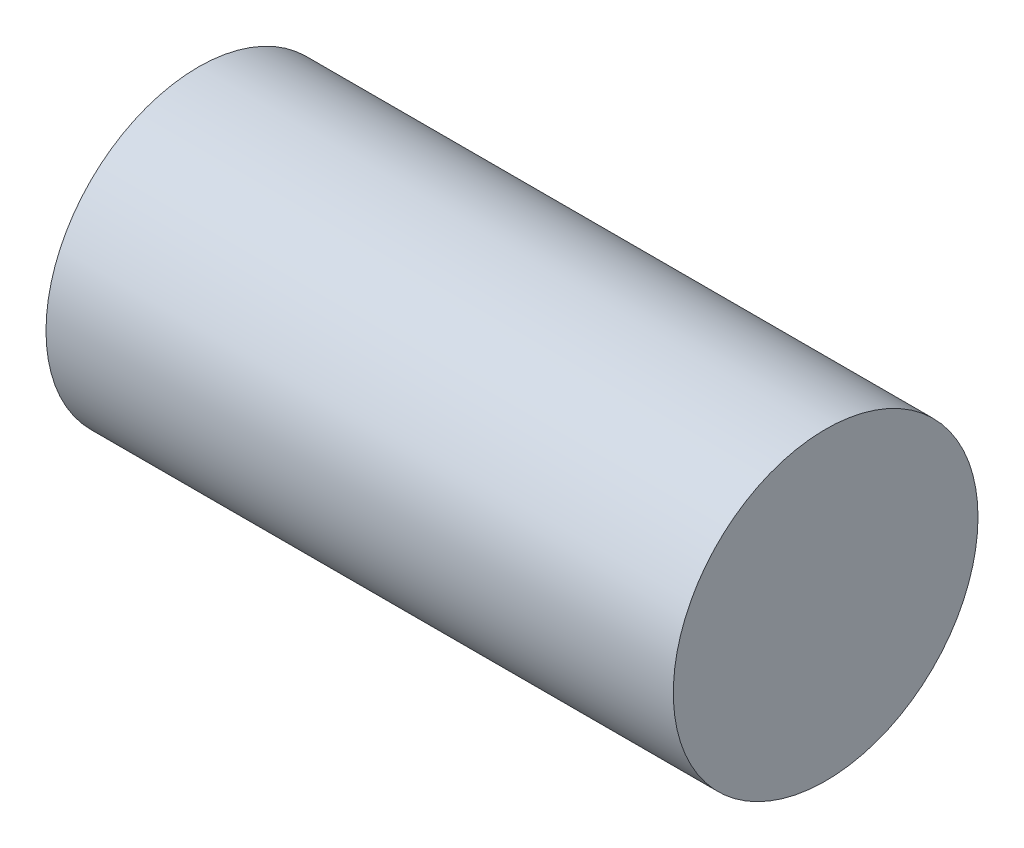
ISO-10303-21;
HEADER;
FILE_DESCRIPTION(('STEP AP214'),'2;1');
FILE_NAME('part.step','',(''),(''),'','','');
FILE_SCHEMA(('AUTOMOTIVE_DESIGN { 1 0 10303 214 1 1 1 1 }'));
ENDSEC;
DATA;
#1=APPLICATION_CONTEXT('core data for automotive mechanical design processes');
#2=APPLICATION_PROTOCOL_DEFINITION('international standard','automotive_design',2000,#1);
#3=PRODUCT_CONTEXT('',#1,'mechanical');
#4=PRODUCT('Part','Part','',(#3));
#5=PRODUCT_RELATED_PRODUCT_CATEGORY('part','',(#4));
#6=PRODUCT_DEFINITION_FORMATION('','',#4);
#7=PRODUCT_DEFINITION_CONTEXT('part definition',#1,'design');
#8=PRODUCT_DEFINITION('design','',#6,#7);
#9=PRODUCT_DEFINITION_SHAPE('','',#8);
#10=(LENGTH_UNIT() NAMED_UNIT(*) SI_UNIT(.MILLI.,.METRE.));
#11=(NAMED_UNIT(*) PLANE_ANGLE_UNIT() SI_UNIT($,.RADIAN.));
#12=(NAMED_UNIT(*) SI_UNIT($,.STERADIAN.) SOLID_ANGLE_UNIT());
#13=UNCERTAINTY_MEASURE_WITH_UNIT(LENGTH_MEASURE(1.E-05),#10,'distance_accuracy_value','');
#14=(GEOMETRIC_REPRESENTATION_CONTEXT(3) GLOBAL_UNCERTAINTY_ASSIGNED_CONTEXT((#13)) GLOBAL_UNIT_ASSIGNED_CONTEXT((#10,
#11,#12)) REPRESENTATION_CONTEXT('',''));
#15=CARTESIAN_POINT('',(0.,0.,0.));
#16=DIRECTION('',(0.,0.,1.));
#17=DIRECTION('',(1.,0.,0.));
#18=AXIS2_PLACEMENT_3D('',#15,#16,#17);
#19=CARTESIAN_POINT('',(-55.0416305603424,0.,0.));
#20=DIRECTION('',(1.,0.,0.));
#21=DIRECTION('',(0.,0.,-1.));
#22=AXIS2_PLACEMENT_3D('',#19,#20,#21);
#23=CYLINDRICAL_SURFACE('',#22,8.50000000000007);
#24=CARTESIAN_POINT('',(2.,0.,0.));
#25=DIRECTION('',(1.,0.,0.));
#26=DIRECTION('',(0.,0.,-1.));
#27=AXIS2_PLACEMENT_3D('',#24,#25,#26);
#28=CIRCLE('',#27,8.50000000000007);
#29=CARTESIAN_POINT('',(2.,0.,-8.50000000000007));
#30=VERTEX_POINT('',#29);
#31=EDGE_CURVE('E10',#30,#30,#28,.T.);
#32=ORIENTED_EDGE('',*,*,#31,.F.);
#33=EDGE_LOOP('',(#32));
#34=FACE_BOUND('',#33,.T.);
#35=CARTESIAN_POINT('',(-32.9999999999996,0.,0.));
#36=DIRECTION('',(-1.,0.,0.));
#37=DIRECTION('',(0.,0.,1.));
#38=AXIS2_PLACEMENT_3D('',#35,#36,#37);
#39=CIRCLE('',#38,8.50000000000007);
#40=CARTESIAN_POINT('',(-32.9999999999996,0.,8.50000000000008));
#41=VERTEX_POINT('',#40);
#42=EDGE_CURVE('E38',#41,#41,#39,.T.);
#43=ORIENTED_EDGE('',*,*,#42,.F.);
#44=EDGE_LOOP('',(#43));
#45=FACE_BOUND('',#44,.T.);
#46=ADVANCED_FACE('F32',(#34,#45),#23,.T.);
#47=CARTESIAN_POINT('',(2.,0.,0.));
#48=DIRECTION('',(1.,0.,0.));
#49=DIRECTION('',(0.,0.,-1.));
#50=AXIS2_PLACEMENT_3D('',#47,#48,#49);
#51=PLANE('',#50);
#52=ORIENTED_EDGE('',*,*,#31,.T.);
#53=EDGE_LOOP('',(#52));
#54=FACE_BOUND('',#53,.T.);
#55=ADVANCED_FACE('F47',(#54),#51,.T.);
#56=CARTESIAN_POINT('',(-32.9999999999996,0.,0.));
#57=DIRECTION('',(-1.,0.,0.));
#58=DIRECTION('',(0.,0.,1.));
#59=AXIS2_PLACEMENT_3D('',#56,#57,#58);
#60=PLANE('',#59);
#61=ORIENTED_EDGE('',*,*,#42,.T.);
#62=EDGE_LOOP('',(#61));
#63=FACE_BOUND('',#62,.T.);
#64=ADVANCED_FACE('F44',(#63),#60,.T.);
#65=CLOSED_SHELL('',(#46,#55,#64));
#66=MANIFOLD_SOLID_BREP('B2',#65);
#67=ADVANCED_BREP_SHAPE_REPRESENTATION('',(#18,#66),#14);
#68=SHAPE_DEFINITION_REPRESENTATION(#9,#67);
ENDSEC;
END-ISO-10303-21;
